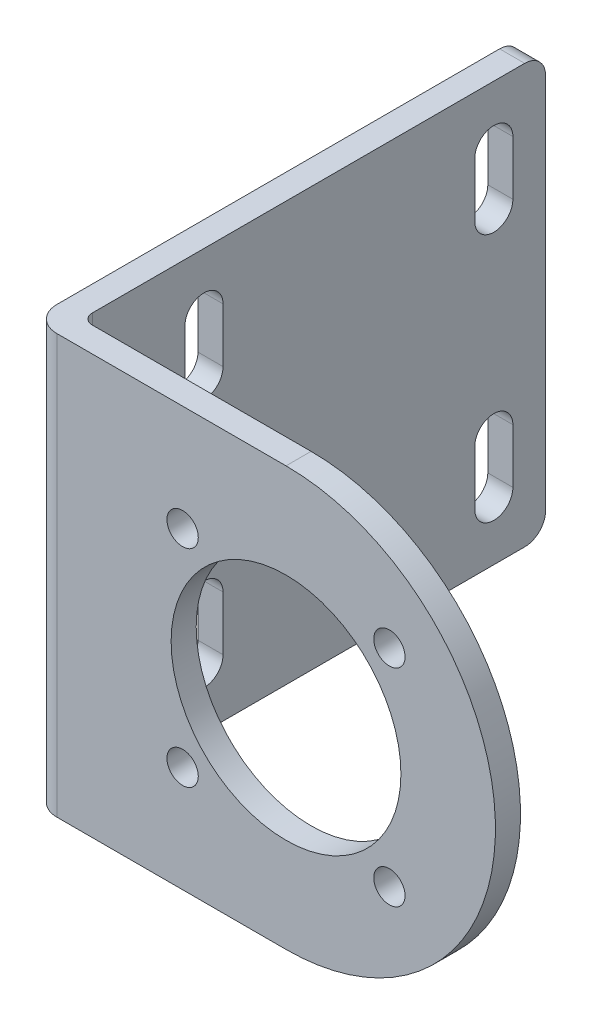
ISO-10303-21;
HEADER;
FILE_DESCRIPTION(('STEP AP214'),'2;1');
FILE_NAME('part.step','',(''),(''),'','','');
FILE_SCHEMA(('AUTOMOTIVE_DESIGN { 1 0 10303 214 1 1 1 1 }'));
ENDSEC;
DATA;
#1=APPLICATION_CONTEXT('core data for automotive mechanical design processes');
#2=APPLICATION_PROTOCOL_DEFINITION('international standard','automotive_design',2000,#1);
#3=PRODUCT_CONTEXT('',#1,'mechanical');
#4=PRODUCT('Part','Part','',(#3));
#5=PRODUCT_RELATED_PRODUCT_CATEGORY('part','',(#4));
#6=PRODUCT_DEFINITION_FORMATION('','',#4);
#7=PRODUCT_DEFINITION_CONTEXT('part definition',#1,'design');
#8=PRODUCT_DEFINITION('design','',#6,#7);
#9=PRODUCT_DEFINITION_SHAPE('','',#8);
#10=(LENGTH_UNIT() NAMED_UNIT(*) SI_UNIT(.MILLI.,.METRE.));
#11=(NAMED_UNIT(*) PLANE_ANGLE_UNIT() SI_UNIT($,.RADIAN.));
#12=(NAMED_UNIT(*) SI_UNIT($,.STERADIAN.) SOLID_ANGLE_UNIT());
#13=UNCERTAINTY_MEASURE_WITH_UNIT(LENGTH_MEASURE(1.E-05),#10,'distance_accuracy_value','');
#14=(GEOMETRIC_REPRESENTATION_CONTEXT(3) GLOBAL_UNCERTAINTY_ASSIGNED_CONTEXT((#13)) GLOBAL_UNIT_ASSIGNED_CONTEXT((#10,
#11,#12)) REPRESENTATION_CONTEXT('',''));
#15=CARTESIAN_POINT('',(0.,0.,0.));
#16=DIRECTION('',(0.,0.,1.));
#17=DIRECTION('',(1.,0.,0.));
#18=AXIS2_PLACEMENT_3D('',#15,#16,#17);
#19=CARTESIAN_POINT('',(0.,0.,0.));
#20=DIRECTION('',(0.,0.,1.));
#21=DIRECTION('',(1.,0.,0.));
#22=AXIS2_PLACEMENT_3D('',#19,#20,#21);
#23=PLANE('',#22);
#24=CARTESIAN_POINT('',(0.,0.,0.));
#25=DIRECTION('',(0.,0.,1.));
#26=DIRECTION('',(1.,0.,0.));
#27=AXIS2_PLACEMENT_3D('',#24,#25,#26);
#28=CIRCLE('',#27,11.);
#29=CARTESIAN_POINT('',(11.,0.,0.));
#30=VERTEX_POINT('',#29);
#31=EDGE_CURVE('E975',#30,#30,#28,.F.);
#32=ORIENTED_EDGE('',*,*,#31,.F.);
#33=EDGE_LOOP('',(#32));
#34=FACE_BOUND('',#33,.T.);
#35=CARTESIAN_POINT('',(9.89949493661172,-9.89949493661161,0.));
#36=DIRECTION('',(0.,0.,1.));
#37=DIRECTION('',(1.,0.,0.));
#38=AXIS2_PLACEMENT_3D('',#35,#36,#37);
#39=CIRCLE('',#38,1.5);
#40=CARTESIAN_POINT('',(11.3994949366117,-9.89949493661161,0.));
#41=VERTEX_POINT('',#40);
#42=EDGE_CURVE('E356',#41,#41,#39,.T.);
#43=ORIENTED_EDGE('',*,*,#42,.T.);
#44=EDGE_LOOP('',(#43));
#45=FACE_BOUND('',#44,.T.);
#46=CARTESIAN_POINT('',(9.89949493661158,9.89949493661175,0.));
#47=DIRECTION('',(0.,0.,1.));
#48=DIRECTION('',(1.,0.,0.));
#49=AXIS2_PLACEMENT_3D('',#46,#47,#48);
#50=CIRCLE('',#49,1.5);
#51=CARTESIAN_POINT('',(11.3994949366116,9.89949493661175,0.));
#52=VERTEX_POINT('',#51);
#53=EDGE_CURVE('E361',#52,#52,#50,.T.);
#54=ORIENTED_EDGE('',*,*,#53,.T.);
#55=EDGE_LOOP('',(#54));
#56=FACE_BOUND('',#55,.T.);
#57=CARTESIAN_POINT('',(-9.89949493661179,9.89949493661154,0.));
#58=DIRECTION('',(0.,0.,1.));
#59=DIRECTION('',(1.,0.,0.));
#60=AXIS2_PLACEMENT_3D('',#57,#58,#59);
#61=CIRCLE('',#60,1.5);
#62=CARTESIAN_POINT('',(-8.39949493661178,9.89949493661154,0.));
#63=VERTEX_POINT('',#62);
#64=EDGE_CURVE('E369',#63,#63,#61,.T.);
#65=ORIENTED_EDGE('',*,*,#64,.T.);
#66=EDGE_LOOP('',(#65));
#67=FACE_BOUND('',#66,.T.);
#68=CARTESIAN_POINT('',(-9.89949493661165,-9.89949493661168,0.));
#69=DIRECTION('',(0.,0.,1.));
#70=DIRECTION('',(1.,0.,0.));
#71=AXIS2_PLACEMENT_3D('',#68,#69,#70);
#72=CIRCLE('',#71,1.5);
#73=CARTESIAN_POINT('',(-8.39949493661165,-9.89949493661168,0.));
#74=VERTEX_POINT('',#73);
#75=EDGE_CURVE('E377',#74,#74,#72,.T.);
#76=ORIENTED_EDGE('',*,*,#75,.T.);
#77=EDGE_LOOP('',(#76));
#78=FACE_BOUND('',#77,.T.);
#79=DIRECTION('',(1.,0.,0.));
#80=VECTOR('',#79,1.);
#81=CARTESIAN_POINT('',(0.,-20.05,0.));
#82=LINE('',#81,#80);
#83=CARTESIAN_POINT('',(-20.95,-20.05,0.));
#84=VERTEX_POINT('',#83);
#85=CARTESIAN_POINT('',(0.,-20.05,0.));
#86=VERTEX_POINT('',#85);
#87=EDGE_CURVE('E385',#84,#86,#82,.T.);
#88=ORIENTED_EDGE('',*,*,#87,.F.);
#89=DIRECTION('',(0.,-1.,0.));
#90=VECTOR('',#89,1.);
#91=CARTESIAN_POINT('',(-20.95,20.05,0.));
#92=LINE('',#91,#90);
#93=CARTESIAN_POINT('',(-20.95,20.05,0.));
#94=VERTEX_POINT('',#93);
#95=EDGE_CURVE('E428',#84,#94,#92,.F.);
#96=ORIENTED_EDGE('',*,*,#95,.T.);
#97=DIRECTION('',(-1.,0.,0.));
#98=VECTOR('',#97,1.);
#99=CARTESIAN_POINT('',(0.,20.05,0.));
#100=LINE('',#99,#98);
#101=CARTESIAN_POINT('',(0.,20.05,0.));
#102=VERTEX_POINT('',#101);
#103=EDGE_CURVE('E393',#102,#94,#100,.T.);
#104=ORIENTED_EDGE('',*,*,#103,.F.);
#105=CARTESIAN_POINT('',(0.,0.,0.));
#106=DIRECTION('',(0.,0.,1.));
#107=DIRECTION('',(1.,0.,0.));
#108=AXIS2_PLACEMENT_3D('',#105,#106,#107);
#109=CIRCLE('',#108,20.05);
#110=EDGE_CURVE('E403',#86,#102,#109,.T.);
#111=ORIENTED_EDGE('',*,*,#110,.F.);
#112=EDGE_LOOP('',(#88,#96,#104,#111));
#113=FACE_BOUND('',#112,.T.);
#114=ADVANCED_FACE('F43',(#34,#45,#56,#67,#78,#113),#23,.F.);
#115=CARTESIAN_POINT('',(0.,0.,2.4));
#116=DIRECTION('',(0.,0.,1.));
#117=DIRECTION('',(1.,0.,0.));
#118=AXIS2_PLACEMENT_3D('',#115,#116,#117);
#119=PLANE('',#118);
#120=CARTESIAN_POINT('',(0.,0.,2.4));
#121=DIRECTION('',(0.,0.,1.));
#122=DIRECTION('',(1.,0.,0.));
#123=AXIS2_PLACEMENT_3D('',#120,#121,#122);
#124=CIRCLE('',#123,11.);
#125=CARTESIAN_POINT('',(11.,0.,2.4));
#126=VERTEX_POINT('',#125);
#127=EDGE_CURVE('E978',#126,#126,#124,.T.);
#128=ORIENTED_EDGE('',*,*,#127,.F.);
#129=EDGE_LOOP('',(#128));
#130=FACE_BOUND('',#129,.T.);
#131=CARTESIAN_POINT('',(9.89949493661158,9.89949493661175,2.4));
#132=DIRECTION('',(0.,0.,1.));
#133=DIRECTION('',(1.,0.,0.));
#134=AXIS2_PLACEMENT_3D('',#131,#132,#133);
#135=CIRCLE('',#134,1.5);
#136=CARTESIAN_POINT('',(11.3994949366116,9.89949493661175,2.4));
#137=VERTEX_POINT('',#136);
#138=EDGE_CURVE('E365',#137,#137,#135,.T.);
#139=ORIENTED_EDGE('',*,*,#138,.F.);
#140=EDGE_LOOP('',(#139));
#141=FACE_BOUND('',#140,.T.);
#142=CARTESIAN_POINT('',(-9.89949493661165,-9.89949493661168,2.4));
#143=DIRECTION('',(0.,0.,1.));
#144=DIRECTION('',(1.,0.,0.));
#145=AXIS2_PLACEMENT_3D('',#142,#143,#144);
#146=CIRCLE('',#145,1.5);
#147=CARTESIAN_POINT('',(-8.39949493661165,-9.89949493661168,2.4));
#148=VERTEX_POINT('',#147);
#149=EDGE_CURVE('E381',#148,#148,#146,.T.);
#150=ORIENTED_EDGE('',*,*,#149,.F.);
#151=EDGE_LOOP('',(#150));
#152=FACE_BOUND('',#151,.T.);
#153=DIRECTION('',(-1.,0.,0.));
#154=VECTOR('',#153,1.);
#155=CARTESIAN_POINT('',(0.,20.05,2.4));
#156=LINE('',#155,#154);
#157=CARTESIAN_POINT('',(0.,20.05,2.4));
#158=VERTEX_POINT('',#157);
#159=CARTESIAN_POINT('',(-21.95,20.05,2.4));
#160=VERTEX_POINT('',#159);
#161=EDGE_CURVE('E396',#158,#160,#156,.T.);
#162=ORIENTED_EDGE('',*,*,#161,.T.);
#163=DIRECTION('',(0.,-1.,0.));
#164=VECTOR('',#163,1.);
#165=CARTESIAN_POINT('',(-21.95,-20.05,2.4));
#166=LINE('',#165,#164);
#167=CARTESIAN_POINT('',(-21.95,-20.05,2.4));
#168=VERTEX_POINT('',#167);
#169=EDGE_CURVE('E438',#160,#168,#166,.T.);
#170=ORIENTED_EDGE('',*,*,#169,.T.);
#171=DIRECTION('',(1.,0.,0.));
#172=VECTOR('',#171,1.);
#173=CARTESIAN_POINT('',(0.,-20.05,2.4));
#174=LINE('',#173,#172);
#175=CARTESIAN_POINT('',(0.,-20.05,2.4));
#176=VERTEX_POINT('',#175);
#177=EDGE_CURVE('E389',#168,#176,#174,.T.);
#178=ORIENTED_EDGE('',*,*,#177,.T.);
#179=CARTESIAN_POINT('',(0.,0.,2.4));
#180=DIRECTION('',(0.,0.,1.));
#181=DIRECTION('',(1.,0.,0.));
#182=AXIS2_PLACEMENT_3D('',#179,#180,#181);
#183=CIRCLE('',#182,20.05);
#184=EDGE_CURVE('E392',#176,#158,#183,.T.);
#185=ORIENTED_EDGE('',*,*,#184,.T.);
#186=EDGE_LOOP('',(#162,#170,#178,#185));
#187=FACE_BOUND('',#186,.T.);
#188=CARTESIAN_POINT('',(-9.89949493661179,9.89949493661154,2.4));
#189=DIRECTION('',(0.,0.,1.));
#190=DIRECTION('',(1.,0.,0.));
#191=AXIS2_PLACEMENT_3D('',#188,#189,#190);
#192=CIRCLE('',#191,1.5);
#193=CARTESIAN_POINT('',(-8.39949493661178,9.89949493661154,2.4));
#194=VERTEX_POINT('',#193);
#195=EDGE_CURVE('E373',#194,#194,#192,.T.);
#196=ORIENTED_EDGE('',*,*,#195,.F.);
#197=EDGE_LOOP('',(#196));
#198=FACE_BOUND('',#197,.T.);
#199=CARTESIAN_POINT('',(9.89949493661172,-9.89949493661161,2.4));
#200=DIRECTION('',(0.,0.,1.));
#201=DIRECTION('',(1.,0.,0.));
#202=AXIS2_PLACEMENT_3D('',#199,#200,#201);
#203=CIRCLE('',#202,1.5);
#204=CARTESIAN_POINT('',(11.3994949366117,-9.89949493661161,2.4));
#205=VERTEX_POINT('',#204);
#206=EDGE_CURVE('E357',#205,#205,#203,.T.);
#207=ORIENTED_EDGE('',*,*,#206,.F.);
#208=EDGE_LOOP('',(#207));
#209=FACE_BOUND('',#208,.T.);
#210=ADVANCED_FACE('F564',(#130,#141,#152,#187,#198,#209),#119,.T.);
#211=CARTESIAN_POINT('',(-24.35,-20.05,2.4));
#212=DIRECTION('',(1.,0.,0.));
#213=DIRECTION('',(0.,0.,-1.));
#214=AXIS2_PLACEMENT_3D('',#211,#212,#213);
#215=PLANE('',#214);
#216=DIRECTION('',(0.,-1.,0.));
#217=VECTOR('',#216,1.);
#218=CARTESIAN_POINT('',(-24.35,-9.34500000000001,-41.27));
#219=LINE('',#218,#217);
#220=CARTESIAN_POINT('',(-24.35,-9.34500000000001,-41.27));
#221=VERTEX_POINT('',#220);
#222=CARTESIAN_POINT('',(-24.35,-14.545,-41.27));
#223=VERTEX_POINT('',#222);
#224=EDGE_CURVE('E264',#221,#223,#219,.T.);
#225=ORIENTED_EDGE('',*,*,#224,.F.);
#226=CARTESIAN_POINT('',(-24.35,-9.34500000000001,-39.445));
#227=DIRECTION('',(-1.,0.,0.));
#228=DIRECTION('',(0.,0.,-1.));
#229=AXIS2_PLACEMENT_3D('',#226,#227,#228);
#230=CIRCLE('',#229,1.82500000000001);
#231=CARTESIAN_POINT('',(-24.35,-9.34500000000001,-37.62));
#232=VERTEX_POINT('',#231);
#233=EDGE_CURVE('E59',#232,#221,#230,.T.);
#234=ORIENTED_EDGE('',*,*,#233,.F.);
#235=DIRECTION('',(0.,1.,0.));
#236=VECTOR('',#235,1.);
#237=CARTESIAN_POINT('',(-24.35,-9.34500000000001,-37.62));
#238=LINE('',#237,#236);
#239=CARTESIAN_POINT('',(-24.35,-14.545,-37.62));
#240=VERTEX_POINT('',#239);
#241=EDGE_CURVE('E273',#240,#232,#238,.T.);
#242=ORIENTED_EDGE('',*,*,#241,.F.);
#243=CARTESIAN_POINT('',(-24.35,-14.545,-39.445));
#244=DIRECTION('',(-1.,0.,0.));
#245=DIRECTION('',(0.,0.,-1.));
#246=AXIS2_PLACEMENT_3D('',#243,#244,#245);
#247=CIRCLE('',#246,1.825);
#248=EDGE_CURVE('E269',#223,#240,#247,.T.);
#249=ORIENTED_EDGE('',*,*,#248,.F.);
#250=EDGE_LOOP('',(#225,#234,#242,#249));
#251=FACE_BOUND('',#250,.T.);
#252=DIRECTION('',(0.,1.,0.));
#253=VECTOR('',#252,1.);
#254=CARTESIAN_POINT('',(-24.35,9.345,-9.87));
#255=LINE('',#254,#253);
#256=CARTESIAN_POINT('',(-24.35,9.345,-9.87));
#257=VERTEX_POINT('',#256);
#258=CARTESIAN_POINT('',(-24.35,14.545,-9.87000000000001));
#259=VERTEX_POINT('',#258);
#260=EDGE_CURVE('E292',#257,#259,#255,.T.);
#261=ORIENTED_EDGE('',*,*,#260,.F.);
#262=CARTESIAN_POINT('',(-24.35,9.345,-11.695));
#263=DIRECTION('',(-1.,0.,0.));
#264=DIRECTION('',(0.,0.,1.));
#265=AXIS2_PLACEMENT_3D('',#262,#263,#264);
#266=CIRCLE('',#265,1.825);
#267=CARTESIAN_POINT('',(-24.35,9.345,-13.52));
#268=VERTEX_POINT('',#267);
#269=EDGE_CURVE('E67',#268,#257,#266,.T.);
#270=ORIENTED_EDGE('',*,*,#269,.F.);
#271=DIRECTION('',(0.,-1.,0.));
#272=VECTOR('',#271,1.);
#273=CARTESIAN_POINT('',(-24.35,9.345,-13.52));
#274=LINE('',#273,#272);
#275=CARTESIAN_POINT('',(-24.35,14.545,-13.52));
#276=VERTEX_POINT('',#275);
#277=EDGE_CURVE('E300',#276,#268,#274,.T.);
#278=ORIENTED_EDGE('',*,*,#277,.F.);
#279=CARTESIAN_POINT('',(-24.35,14.545,-11.695));
#280=DIRECTION('',(-1.,0.,0.));
#281=DIRECTION('',(0.,0.,1.));
#282=AXIS2_PLACEMENT_3D('',#279,#280,#281);
#283=CIRCLE('',#282,1.825);
#284=EDGE_CURVE('E296',#259,#276,#283,.T.);
#285=ORIENTED_EDGE('',*,*,#284,.F.);
#286=EDGE_LOOP('',(#261,#270,#278,#285));
#287=FACE_BOUND('',#286,.T.);
#288=DIRECTION('',(0.,-1.,0.));
#289=VECTOR('',#288,1.);
#290=CARTESIAN_POINT('',(-24.35,-9.34500000000001,-13.52));
#291=LINE('',#290,#289);
#292=CARTESIAN_POINT('',(-24.35,-9.34500000000001,-13.52));
#293=VERTEX_POINT('',#292);
#294=CARTESIAN_POINT('',(-24.35,-14.545,-13.52));
#295=VERTEX_POINT('',#294);
#296=EDGE_CURVE('E236',#293,#295,#291,.T.);
#297=ORIENTED_EDGE('',*,*,#296,.F.);
#298=CARTESIAN_POINT('',(-24.35,-9.34500000000001,-11.695));
#299=DIRECTION('',(-1.,0.,0.));
#300=DIRECTION('',(0.,0.,-1.));
#301=AXIS2_PLACEMENT_3D('',#298,#299,#300);
#302=CIRCLE('',#301,1.825);
#303=CARTESIAN_POINT('',(-24.35,-9.34500000000001,-9.87));
#304=VERTEX_POINT('',#303);
#305=EDGE_CURVE('E242',#304,#293,#302,.T.);
#306=ORIENTED_EDGE('',*,*,#305,.F.);
#307=DIRECTION('',(0.,1.,0.));
#308=VECTOR('',#307,1.);
#309=CARTESIAN_POINT('',(-24.35,-9.34500000000001,-9.87));
#310=LINE('',#309,#308);
#311=CARTESIAN_POINT('',(-24.35,-14.545,-9.87));
#312=VERTEX_POINT('',#311);
#313=EDGE_CURVE('E247',#312,#304,#310,.T.);
#314=ORIENTED_EDGE('',*,*,#313,.F.);
#315=CARTESIAN_POINT('',(-24.35,-14.545,-11.695));
#316=DIRECTION('',(-1.,0.,0.));
#317=DIRECTION('',(0.,0.,-1.));
#318=AXIS2_PLACEMENT_3D('',#315,#316,#317);
#319=CIRCLE('',#318,1.825);
#320=EDGE_CURVE('E224',#295,#312,#319,.T.);
#321=ORIENTED_EDGE('',*,*,#320,.F.);
#322=EDGE_LOOP('',(#297,#306,#314,#321));
#323=FACE_BOUND('',#322,.T.);
#324=DIRECTION('',(0.,1.,0.));
#325=VECTOR('',#324,1.);
#326=CARTESIAN_POINT('',(-24.35,9.345,-37.62));
#327=LINE('',#326,#325);
#328=CARTESIAN_POINT('',(-24.35,9.345,-37.62));
#329=VERTEX_POINT('',#328);
#330=CARTESIAN_POINT('',(-24.35,14.545,-37.62));
#331=VERTEX_POINT('',#330);
#332=EDGE_CURVE('E317',#329,#331,#327,.T.);
#333=ORIENTED_EDGE('',*,*,#332,.F.);
#334=CARTESIAN_POINT('',(-24.35,9.345,-39.445));
#335=DIRECTION('',(-1.,0.,0.));
#336=DIRECTION('',(0.,0.,1.));
#337=AXIS2_PLACEMENT_3D('',#334,#335,#336);
#338=CIRCLE('',#337,1.82500000000001);
#339=CARTESIAN_POINT('',(-24.35,9.345,-41.27));
#340=VERTEX_POINT('',#339);
#341=EDGE_CURVE('E281',#340,#329,#338,.T.);
#342=ORIENTED_EDGE('',*,*,#341,.F.);
#343=DIRECTION('',(0.,-1.,0.));
#344=VECTOR('',#343,1.);
#345=CARTESIAN_POINT('',(-24.35,9.345,-41.27));
#346=LINE('',#345,#344);
#347=CARTESIAN_POINT('',(-24.35,14.545,-41.27));
#348=VERTEX_POINT('',#347);
#349=EDGE_CURVE('E325',#348,#340,#346,.T.);
#350=ORIENTED_EDGE('',*,*,#349,.F.);
#351=CARTESIAN_POINT('',(-24.35,14.545,-39.445));
#352=DIRECTION('',(-1.,0.,0.));
#353=DIRECTION('',(0.,0.,1.));
#354=AXIS2_PLACEMENT_3D('',#351,#352,#353);
#355=CIRCLE('',#354,1.825);
#356=EDGE_CURVE('E321',#331,#348,#355,.T.);
#357=ORIENTED_EDGE('',*,*,#356,.F.);
#358=EDGE_LOOP('',(#333,#342,#350,#357));
#359=FACE_BOUND('',#358,.T.);
#360=DIRECTION('',(0.,0.,-1.));
#361=VECTOR('',#360,1.);
#362=CARTESIAN_POINT('',(-24.35,20.05,2.4));
#363=LINE('',#362,#361);
#364=CARTESIAN_POINT('',(-24.35,20.05,0.));
#365=VERTEX_POINT('',#364);
#366=CARTESIAN_POINT('',(-24.35,20.05,-42.4));
#367=VERTEX_POINT('',#366);
#368=EDGE_CURVE('E400',#365,#367,#363,.T.);
#369=ORIENTED_EDGE('',*,*,#368,.T.);
#370=CARTESIAN_POINT('',(-24.35,18.05,-42.4));
#371=DIRECTION('',(1.,0.,0.));
#372=DIRECTION('',(0.,0.,-1.));
#373=AXIS2_PLACEMENT_3D('',#370,#371,#372);
#374=CIRCLE('',#373,2.);
#375=CARTESIAN_POINT('',(-24.35,18.05,-44.4));
#376=VERTEX_POINT('',#375);
#377=EDGE_CURVE('E471',#367,#376,#374,.F.);
#378=ORIENTED_EDGE('',*,*,#377,.T.);
#379=DIRECTION('',(0.,1.,0.));
#380=VECTOR('',#379,1.);
#381=CARTESIAN_POINT('',(-24.35,-20.05,-44.4));
#382=LINE('',#381,#380);
#383=CARTESIAN_POINT('',(-24.35,-18.05,-44.4));
#384=VERTEX_POINT('',#383);
#385=EDGE_CURVE('E333',#384,#376,#382,.T.);
#386=ORIENTED_EDGE('',*,*,#385,.F.);
#387=CARTESIAN_POINT('',(-24.35,-18.05,-42.4));
#388=DIRECTION('',(1.,0.,0.));
#389=DIRECTION('',(0.,0.,-1.));
#390=AXIS2_PLACEMENT_3D('',#387,#388,#389);
#391=CIRCLE('',#390,2.);
#392=CARTESIAN_POINT('',(-24.35,-20.05,-42.4));
#393=VERTEX_POINT('',#392);
#394=EDGE_CURVE('E468',#384,#393,#391,.F.);
#395=ORIENTED_EDGE('',*,*,#394,.T.);
#396=DIRECTION('',(0.,0.,-1.));
#397=VECTOR('',#396,1.);
#398=CARTESIAN_POINT('',(-24.35,-20.05,2.4));
#399=LINE('',#398,#397);
#400=CARTESIAN_POINT('',(-24.35,-20.05,0.));
#401=VERTEX_POINT('',#400);
#402=EDGE_CURVE('E420',#401,#393,#399,.T.);
#403=ORIENTED_EDGE('',*,*,#402,.F.);
#404=DIRECTION('',(0.,-1.,0.));
#405=VECTOR('',#404,1.);
#406=CARTESIAN_POINT('',(-24.35,20.05,0.));
#407=LINE('',#406,#405);
#408=EDGE_CURVE('E445',#401,#365,#407,.F.);
#409=ORIENTED_EDGE('',*,*,#408,.T.);
#410=EDGE_LOOP('',(#369,#378,#386,#395,#403,#409));
#411=FACE_BOUND('',#410,.T.);
#412=ADVANCED_FACE('F244',(#251,#287,#323,#359,#411),#215,.F.);
#413=CARTESIAN_POINT('',(0.,-20.05,2.4));
#414=DIRECTION('',(0.,1.,0.));
#415=DIRECTION('',(0.,0.,1.));
#416=AXIS2_PLACEMENT_3D('',#413,#414,#415);
#417=PLANE('',#416);
#418=ORIENTED_EDGE('',*,*,#402,.T.);
#419=DIRECTION('',(-1.,0.,0.));
#420=VECTOR('',#419,1.);
#421=CARTESIAN_POINT('',(-21.95,-20.05,-42.4));
#422=LINE('',#421,#420);
#423=CARTESIAN_POINT('',(-21.95,-20.05,-42.4));
#424=VERTEX_POINT('',#423);
#425=EDGE_CURVE('E474',#393,#424,#422,.F.);
#426=ORIENTED_EDGE('',*,*,#425,.T.);
#427=DIRECTION('',(0.,0.,1.));
#428=VECTOR('',#427,1.);
#429=CARTESIAN_POINT('',(-21.95,-20.05,-44.4));
#430=LINE('',#429,#428);
#431=CARTESIAN_POINT('',(-21.95,-20.05,-1.));
#432=VERTEX_POINT('',#431);
#433=EDGE_CURVE('E350',#424,#432,#430,.T.);
#434=ORIENTED_EDGE('',*,*,#433,.T.);
#435=CARTESIAN_POINT('',(-20.95,-20.05,-1.));
#436=DIRECTION('',(0.,1.,0.));
#437=DIRECTION('',(0.,0.,1.));
#438=AXIS2_PLACEMENT_3D('',#435,#436,#437);
#439=CIRCLE('',#438,1.);
#440=EDGE_CURVE('E431',#432,#84,#439,.T.);
#441=ORIENTED_EDGE('',*,*,#440,.T.);
#442=ORIENTED_EDGE('',*,*,#87,.T.);
#443=DIRECTION('',(0.,0.,-1.));
#444=VECTOR('',#443,1.);
#445=CARTESIAN_POINT('',(0.,-20.05,2.4));
#446=LINE('',#445,#444);
#447=EDGE_CURVE('E416',#176,#86,#446,.T.);
#448=ORIENTED_EDGE('',*,*,#447,.F.);
#449=ORIENTED_EDGE('',*,*,#177,.F.);
#450=CARTESIAN_POINT('',(-21.95,-20.05,0.));
#451=DIRECTION('',(0.,1.,0.));
#452=DIRECTION('',(0.,0.,1.));
#453=AXIS2_PLACEMENT_3D('',#450,#451,#452);
#454=CIRCLE('',#453,2.4);
#455=EDGE_CURVE('E442',#168,#401,#454,.F.);
#456=ORIENTED_EDGE('',*,*,#455,.T.);
#457=EDGE_LOOP('',(#418,#426,#434,#441,#442,#448,#449,#456));
#458=FACE_BOUND('',#457,.T.);
#459=ADVANCED_FACE('F584',(#458),#417,.F.);
#460=CARTESIAN_POINT('',(0.,0.,2.4));
#461=DIRECTION('',(0.,0.,-1.));
#462=DIRECTION('',(-1.,0.,0.));
#463=AXIS2_PLACEMENT_3D('',#460,#461,#462);
#464=CYLINDRICAL_SURFACE('',#463,20.05);
#465=ORIENTED_EDGE('',*,*,#110,.T.);
#466=DIRECTION('',(0.,0.,-1.));
#467=VECTOR('',#466,1.);
#468=CARTESIAN_POINT('',(0.,20.05,2.4));
#469=LINE('',#468,#467);
#470=EDGE_CURVE('E412',#158,#102,#469,.T.);
#471=ORIENTED_EDGE('',*,*,#470,.F.);
#472=ORIENTED_EDGE('',*,*,#184,.F.);
#473=ORIENTED_EDGE('',*,*,#447,.T.);
#474=EDGE_LOOP('',(#465,#471,#472,#473));
#475=FACE_BOUND('',#474,.T.);
#476=ADVANCED_FACE('F580',(#475),#464,.T.);
#477=CARTESIAN_POINT('',(0.,20.05,2.4));
#478=DIRECTION('',(0.,-1.,0.));
#479=DIRECTION('',(1.,0.,0.));
#480=AXIS2_PLACEMENT_3D('',#477,#478,#479);
#481=PLANE('',#480);
#482=DIRECTION('',(0.,0.,1.));
#483=VECTOR('',#482,1.);
#484=CARTESIAN_POINT('',(-21.95,20.05,-44.4));
#485=LINE('',#484,#483);
#486=CARTESIAN_POINT('',(-21.95,20.05,-42.4));
#487=VERTEX_POINT('',#486);
#488=CARTESIAN_POINT('',(-21.95,20.05,-1.));
#489=VERTEX_POINT('',#488);
#490=EDGE_CURVE('E353',#487,#489,#485,.T.);
#491=ORIENTED_EDGE('',*,*,#490,.F.);
#492=DIRECTION('',(1.,0.,0.));
#493=VECTOR('',#492,1.);
#494=CARTESIAN_POINT('',(-24.35,20.05,-42.4));
#495=LINE('',#494,#493);
#496=EDGE_CURVE('E465',#487,#367,#495,.F.);
#497=ORIENTED_EDGE('',*,*,#496,.T.);
#498=ORIENTED_EDGE('',*,*,#368,.F.);
#499=CARTESIAN_POINT('',(-21.95,20.05,0.));
#500=DIRECTION('',(0.,-1.,0.));
#501=DIRECTION('',(1.,0.,0.));
#502=AXIS2_PLACEMENT_3D('',#499,#500,#501);
#503=CIRCLE('',#502,2.4);
#504=EDGE_CURVE('E448',#365,#160,#503,.F.);
#505=ORIENTED_EDGE('',*,*,#504,.T.);
#506=ORIENTED_EDGE('',*,*,#161,.F.);
#507=ORIENTED_EDGE('',*,*,#470,.T.);
#508=ORIENTED_EDGE('',*,*,#103,.T.);
#509=CARTESIAN_POINT('',(-20.95,20.05,-1.));
#510=DIRECTION('',(0.,-1.,0.));
#511=DIRECTION('',(1.,0.,0.));
#512=AXIS2_PLACEMENT_3D('',#509,#510,#511);
#513=CIRCLE('',#512,1.);
#514=EDGE_CURVE('E434',#94,#489,#513,.T.);
#515=ORIENTED_EDGE('',*,*,#514,.T.);
#516=EDGE_LOOP('',(#491,#497,#498,#505,#506,#507,#508,#515));
#517=FACE_BOUND('',#516,.T.);
#518=ADVANCED_FACE('F576',(#517),#481,.F.);
#519=CARTESIAN_POINT('',(-9.89949493661165,-9.89949493661168,2.4));
#520=DIRECTION('',(0.,0.,-1.));
#521=DIRECTION('',(-1.,0.,0.));
#522=AXIS2_PLACEMENT_3D('',#519,#520,#521);
#523=CYLINDRICAL_SURFACE('',#522,1.5);
#524=ORIENTED_EDGE('',*,*,#149,.T.);
#525=EDGE_LOOP('',(#524));
#526=FACE_BOUND('',#525,.T.);
#527=ORIENTED_EDGE('',*,*,#75,.F.);
#528=EDGE_LOOP('',(#527));
#529=FACE_BOUND('',#528,.T.);
#530=ADVANCED_FACE('F579',(#526,#529),#523,.F.);
#531=CARTESIAN_POINT('',(-9.89949493661179,9.89949493661154,2.4));
#532=DIRECTION('',(0.,0.,-1.));
#533=DIRECTION('',(-1.,0.,0.));
#534=AXIS2_PLACEMENT_3D('',#531,#532,#533);
#535=CYLINDRICAL_SURFACE('',#534,1.5);
#536=ORIENTED_EDGE('',*,*,#195,.T.);
#537=EDGE_LOOP('',(#536));
#538=FACE_BOUND('',#537,.T.);
#539=ORIENTED_EDGE('',*,*,#64,.F.);
#540=EDGE_LOOP('',(#539));
#541=FACE_BOUND('',#540,.T.);
#542=ADVANCED_FACE('F655',(#538,#541),#535,.F.);
#543=CARTESIAN_POINT('',(9.89949493661158,9.89949493661175,2.4));
#544=DIRECTION('',(0.,0.,-1.));
#545=DIRECTION('',(-1.,0.,0.));
#546=AXIS2_PLACEMENT_3D('',#543,#544,#545);
#547=CYLINDRICAL_SURFACE('',#546,1.5);
#548=ORIENTED_EDGE('',*,*,#138,.T.);
#549=EDGE_LOOP('',(#548));
#550=FACE_BOUND('',#549,.T.);
#551=ORIENTED_EDGE('',*,*,#53,.F.);
#552=EDGE_LOOP('',(#551));
#553=FACE_BOUND('',#552,.T.);
#554=ADVANCED_FACE('F648',(#550,#553),#547,.F.);
#555=CARTESIAN_POINT('',(9.89949493661172,-9.89949493661161,2.4));
#556=DIRECTION('',(0.,0.,-1.));
#557=DIRECTION('',(-1.,0.,0.));
#558=AXIS2_PLACEMENT_3D('',#555,#556,#557);
#559=CYLINDRICAL_SURFACE('',#558,1.5);
#560=ORIENTED_EDGE('',*,*,#206,.T.);
#561=EDGE_LOOP('',(#560));
#562=FACE_BOUND('',#561,.T.);
#563=ORIENTED_EDGE('',*,*,#42,.F.);
#564=EDGE_LOOP('',(#563));
#565=FACE_BOUND('',#564,.T.);
#566=ADVANCED_FACE('F641',(#562,#565),#559,.F.);
#567=CARTESIAN_POINT('',(-21.95,-20.05,-44.4));
#568=DIRECTION('',(-1.,0.,0.));
#569=DIRECTION('',(0.,0.,1.));
#570=AXIS2_PLACEMENT_3D('',#567,#568,#569);
#571=PLANE('',#570);
#572=DIRECTION('',(0.,1.,0.));
#573=VECTOR('',#572,1.);
#574=CARTESIAN_POINT('',(-21.95,-20.05,-37.62));
#575=LINE('',#574,#573);
#576=CARTESIAN_POINT('',(-21.95,-14.545,-37.62));
#577=VERTEX_POINT('',#576);
#578=CARTESIAN_POINT('',(-21.95,-9.34500000000001,-37.62));
#579=VERTEX_POINT('',#578);
#580=EDGE_CURVE('E52',#577,#579,#575,.T.);
#581=ORIENTED_EDGE('',*,*,#580,.T.);
#582=CARTESIAN_POINT('',(-21.95,-9.34500000000001,-39.445));
#583=DIRECTION('',(-1.,0.,0.));
#584=DIRECTION('',(0.,0.,1.));
#585=AXIS2_PLACEMENT_3D('',#582,#583,#584);
#586=CIRCLE('',#585,1.82500000000001);
#587=CARTESIAN_POINT('',(-21.95,-9.34500000000001,-41.27));
#588=VERTEX_POINT('',#587);
#589=EDGE_CURVE('E11',#579,#588,#586,.T.);
#590=ORIENTED_EDGE('',*,*,#589,.T.);
#591=DIRECTION('',(0.,-1.,0.));
#592=VECTOR('',#591,1.);
#593=CARTESIAN_POINT('',(-21.95,-20.05,-41.27));
#594=LINE('',#593,#592);
#595=CARTESIAN_POINT('',(-21.95,-14.545,-41.27));
#596=VERTEX_POINT('',#595);
#597=EDGE_CURVE('E522',#588,#596,#594,.T.);
#598=ORIENTED_EDGE('',*,*,#597,.T.);
#599=CARTESIAN_POINT('',(-21.95,-14.545,-39.445));
#600=DIRECTION('',(-1.,0.,0.));
#601=DIRECTION('',(0.,0.,1.));
#602=AXIS2_PLACEMENT_3D('',#599,#600,#601);
#603=CIRCLE('',#602,1.825);
#604=EDGE_CURVE('E526',#596,#577,#603,.T.);
#605=ORIENTED_EDGE('',*,*,#604,.T.);
#606=EDGE_LOOP('',(#581,#590,#598,#605));
#607=FACE_BOUND('',#606,.T.);
#608=DIRECTION('',(0.,-1.,0.));
#609=VECTOR('',#608,1.);
#610=CARTESIAN_POINT('',(-21.95,-20.05,-13.52));
#611=LINE('',#610,#609);
#612=CARTESIAN_POINT('',(-21.95,14.545,-13.52));
#613=VERTEX_POINT('',#612);
#614=CARTESIAN_POINT('',(-21.95,9.345,-13.52));
#615=VERTEX_POINT('',#614);
#616=EDGE_CURVE('E514',#613,#615,#611,.T.);
#617=ORIENTED_EDGE('',*,*,#616,.T.);
#618=CARTESIAN_POINT('',(-21.95,9.345,-11.695));
#619=DIRECTION('',(-1.,0.,0.));
#620=DIRECTION('',(0.,0.,1.));
#621=AXIS2_PLACEMENT_3D('',#618,#619,#620);
#622=CIRCLE('',#621,1.825);
#623=CARTESIAN_POINT('',(-21.95,9.345,-9.87));
#624=VERTEX_POINT('',#623);
#625=EDGE_CURVE('E518',#615,#624,#622,.T.);
#626=ORIENTED_EDGE('',*,*,#625,.T.);
#627=DIRECTION('',(0.,1.,0.));
#628=VECTOR('',#627,1.);
#629=CARTESIAN_POINT('',(-21.95,-20.05,-9.86999999999998));
#630=LINE('',#629,#628);
#631=CARTESIAN_POINT('',(-21.95,14.545,-9.87));
#632=VERTEX_POINT('',#631);
#633=EDGE_CURVE('E506',#624,#632,#630,.T.);
#634=ORIENTED_EDGE('',*,*,#633,.T.);
#635=CARTESIAN_POINT('',(-21.95,14.545,-11.695));
#636=DIRECTION('',(-1.,0.,0.));
#637=DIRECTION('',(0.,0.,1.));
#638=AXIS2_PLACEMENT_3D('',#635,#636,#637);
#639=CIRCLE('',#638,1.825);
#640=EDGE_CURVE('E510',#632,#613,#639,.T.);
#641=ORIENTED_EDGE('',*,*,#640,.T.);
#642=EDGE_LOOP('',(#617,#626,#634,#641));
#643=FACE_BOUND('',#642,.T.);
#644=DIRECTION('',(0.,1.,0.));
#645=VECTOR('',#644,1.);
#646=CARTESIAN_POINT('',(-21.95,-20.05,-9.87));
#647=LINE('',#646,#645);
#648=CARTESIAN_POINT('',(-21.95,-14.545,-9.87));
#649=VERTEX_POINT('',#648);
#650=CARTESIAN_POINT('',(-21.95,-9.34500000000001,-9.87));
#651=VERTEX_POINT('',#650);
#652=EDGE_CURVE('E498',#649,#651,#647,.T.);
#653=ORIENTED_EDGE('',*,*,#652,.T.);
#654=CARTESIAN_POINT('',(-21.95,-9.34500000000001,-11.695));
#655=DIRECTION('',(-1.,0.,0.));
#656=DIRECTION('',(0.,0.,1.));
#657=AXIS2_PLACEMENT_3D('',#654,#655,#656);
#658=CIRCLE('',#657,1.825);
#659=CARTESIAN_POINT('',(-21.95,-9.34500000000001,-13.52));
#660=VERTEX_POINT('',#659);
#661=EDGE_CURVE('E502',#651,#660,#658,.T.);
#662=ORIENTED_EDGE('',*,*,#661,.T.);
#663=DIRECTION('',(0.,-1.,0.));
#664=VECTOR('',#663,1.);
#665=CARTESIAN_POINT('',(-21.95,-20.05,-13.52));
#666=LINE('',#665,#664);
#667=CARTESIAN_POINT('',(-21.95,-14.545,-13.52));
#668=VERTEX_POINT('',#667);
#669=EDGE_CURVE('E493',#660,#668,#666,.T.);
#670=ORIENTED_EDGE('',*,*,#669,.T.);
#671=CARTESIAN_POINT('',(-21.95,-14.545,-11.695));
#672=DIRECTION('',(-1.,0.,0.));
#673=DIRECTION('',(0.,0.,1.));
#674=AXIS2_PLACEMENT_3D('',#671,#672,#673);
#675=CIRCLE('',#674,1.825);
#676=EDGE_CURVE('E227',#668,#649,#675,.T.);
#677=ORIENTED_EDGE('',*,*,#676,.T.);
#678=EDGE_LOOP('',(#653,#662,#670,#677));
#679=FACE_BOUND('',#678,.T.);
#680=DIRECTION('',(0.,-1.,0.));
#681=VECTOR('',#680,1.);
#682=CARTESIAN_POINT('',(-21.95,-20.05,-41.27));
#683=LINE('',#682,#681);
#684=CARTESIAN_POINT('',(-21.95,14.545,-41.27));
#685=VERTEX_POINT('',#684);
#686=CARTESIAN_POINT('',(-21.95,9.345,-41.27));
#687=VERTEX_POINT('',#686);
#688=EDGE_CURVE('E485',#685,#687,#683,.T.);
#689=ORIENTED_EDGE('',*,*,#688,.T.);
#690=CARTESIAN_POINT('',(-21.95,9.345,-39.445));
#691=DIRECTION('',(-1.,0.,0.));
#692=DIRECTION('',(0.,0.,1.));
#693=AXIS2_PLACEMENT_3D('',#690,#691,#692);
#694=CIRCLE('',#693,1.82500000000001);
#695=CARTESIAN_POINT('',(-21.95,9.345,-37.62));
#696=VERTEX_POINT('',#695);
#697=EDGE_CURVE('E489',#687,#696,#694,.T.);
#698=ORIENTED_EDGE('',*,*,#697,.T.);
#699=DIRECTION('',(0.,1.,0.));
#700=VECTOR('',#699,1.);
#701=CARTESIAN_POINT('',(-21.95,-20.05,-37.6199999999999));
#702=LINE('',#701,#700);
#703=CARTESIAN_POINT('',(-21.95,14.545,-37.62));
#704=VERTEX_POINT('',#703);
#705=EDGE_CURVE('E477',#696,#704,#702,.T.);
#706=ORIENTED_EDGE('',*,*,#705,.T.);
#707=CARTESIAN_POINT('',(-21.95,14.545,-39.445));
#708=DIRECTION('',(-1.,0.,0.));
#709=DIRECTION('',(0.,0.,1.));
#710=AXIS2_PLACEMENT_3D('',#707,#708,#709);
#711=CIRCLE('',#710,1.825);
#712=EDGE_CURVE('E481',#704,#685,#711,.T.);
#713=ORIENTED_EDGE('',*,*,#712,.T.);
#714=EDGE_LOOP('',(#689,#698,#706,#713));
#715=FACE_BOUND('',#714,.T.);
#716=DIRECTION('',(0.,-1.,0.));
#717=VECTOR('',#716,1.);
#718=CARTESIAN_POINT('',(-21.95,-20.05,-44.4));
#719=LINE('',#718,#717);
#720=CARTESIAN_POINT('',(-21.95,18.05,-44.4));
#721=VERTEX_POINT('',#720);
#722=CARTESIAN_POINT('',(-21.95,-18.05,-44.4));
#723=VERTEX_POINT('',#722);
#724=EDGE_CURVE('E346',#721,#723,#719,.T.);
#725=ORIENTED_EDGE('',*,*,#724,.F.);
#726=CARTESIAN_POINT('',(-21.95,18.05,-42.4));
#727=DIRECTION('',(-1.,0.,0.));
#728=DIRECTION('',(0.,0.,1.));
#729=AXIS2_PLACEMENT_3D('',#726,#727,#728);
#730=CIRCLE('',#729,2.);
#731=EDGE_CURVE('E462',#721,#487,#730,.F.);
#732=ORIENTED_EDGE('',*,*,#731,.T.);
#733=ORIENTED_EDGE('',*,*,#490,.T.);
#734=DIRECTION('',(0.,-1.,0.));
#735=VECTOR('',#734,1.);
#736=CARTESIAN_POINT('',(-21.95,-20.05,-1.));
#737=LINE('',#736,#735);
#738=EDGE_CURVE('E424',#489,#432,#737,.T.);
#739=ORIENTED_EDGE('',*,*,#738,.T.);
#740=ORIENTED_EDGE('',*,*,#433,.F.);
#741=CARTESIAN_POINT('',(-21.95,-18.05,-42.4));
#742=DIRECTION('',(-1.,0.,0.));
#743=DIRECTION('',(0.,0.,1.));
#744=AXIS2_PLACEMENT_3D('',#741,#742,#743);
#745=CIRCLE('',#744,2.);
#746=EDGE_CURVE('E459',#424,#723,#745,.F.);
#747=ORIENTED_EDGE('',*,*,#746,.T.);
#748=EDGE_LOOP('',(#725,#732,#733,#739,#740,#747));
#749=FACE_BOUND('',#748,.T.);
#750=ADVANCED_FACE('F533',(#607,#643,#679,#715,#749),#571,.F.);
#751=CARTESIAN_POINT('',(0.,0.,-44.4));
#752=DIRECTION('',(0.,0.,-1.));
#753=DIRECTION('',(-1.,0.,0.));
#754=AXIS2_PLACEMENT_3D('',#751,#752,#753);
#755=PLANE('',#754);
#756=ORIENTED_EDGE('',*,*,#385,.T.);
#757=DIRECTION('',(1.,0.,0.));
#758=VECTOR('',#757,1.);
#759=CARTESIAN_POINT('',(-21.95,18.05,-44.4));
#760=LINE('',#759,#758);
#761=EDGE_CURVE('E455',#376,#721,#760,.T.);
#762=ORIENTED_EDGE('',*,*,#761,.T.);
#763=ORIENTED_EDGE('',*,*,#724,.T.);
#764=DIRECTION('',(-1.,0.,0.));
#765=VECTOR('',#764,1.);
#766=CARTESIAN_POINT('',(-24.35,-18.05,-44.4));
#767=LINE('',#766,#765);
#768=EDGE_CURVE('E451',#723,#384,#767,.T.);
#769=ORIENTED_EDGE('',*,*,#768,.T.);
#770=EDGE_LOOP('',(#756,#762,#763,#769));
#771=FACE_BOUND('',#770,.T.);
#772=ADVANCED_FACE('F595',(#771),#755,.T.);
#773=CARTESIAN_POINT('',(-20.95,-20.05,-1.));
#774=DIRECTION('',(0.,1.,0.));
#775=DIRECTION('',(0.,0.,1.));
#776=AXIS2_PLACEMENT_3D('',#773,#774,#775);
#777=CYLINDRICAL_SURFACE('',#776,1.);
#778=ORIENTED_EDGE('',*,*,#514,.F.);
#779=ORIENTED_EDGE('',*,*,#95,.F.);
#780=ORIENTED_EDGE('',*,*,#440,.F.);
#781=ORIENTED_EDGE('',*,*,#738,.F.);
#782=EDGE_LOOP('',(#778,#779,#780,#781));
#783=FACE_BOUND('',#782,.T.);
#784=ADVANCED_FACE('F591',(#783),#777,.F.);
#785=CARTESIAN_POINT('',(-21.95,0.,0.));
#786=DIRECTION('',(0.,1.,0.));
#787=DIRECTION('',(0.,0.,1.));
#788=AXIS2_PLACEMENT_3D('',#785,#786,#787);
#789=CYLINDRICAL_SURFACE('',#788,2.4);
#790=ORIENTED_EDGE('',*,*,#504,.F.);
#791=ORIENTED_EDGE('',*,*,#408,.F.);
#792=ORIENTED_EDGE('',*,*,#455,.F.);
#793=ORIENTED_EDGE('',*,*,#169,.F.);
#794=EDGE_LOOP('',(#790,#791,#792,#793));
#795=FACE_BOUND('',#794,.T.);
#796=ADVANCED_FACE('F594',(#795),#789,.T.);
#797=CARTESIAN_POINT('',(0.,18.05,-42.4));
#798=DIRECTION('',(-1.,0.,0.));
#799=DIRECTION('',(0.,-1.,0.));
#800=AXIS2_PLACEMENT_3D('',#797,#798,#799);
#801=CYLINDRICAL_SURFACE('',#800,2.);
#802=ORIENTED_EDGE('',*,*,#377,.F.);
#803=ORIENTED_EDGE('',*,*,#496,.F.);
#804=ORIENTED_EDGE('',*,*,#731,.F.);
#805=ORIENTED_EDGE('',*,*,#761,.F.);
#806=EDGE_LOOP('',(#802,#803,#804,#805));
#807=FACE_BOUND('',#806,.T.);
#808=ADVANCED_FACE('F598',(#807),#801,.T.);
#809=CARTESIAN_POINT('',(0.,-18.05,-42.4));
#810=DIRECTION('',(1.,0.,0.));
#811=DIRECTION('',(0.,0.,-1.));
#812=AXIS2_PLACEMENT_3D('',#809,#810,#811);
#813=CYLINDRICAL_SURFACE('',#812,2.);
#814=ORIENTED_EDGE('',*,*,#746,.F.);
#815=ORIENTED_EDGE('',*,*,#425,.F.);
#816=ORIENTED_EDGE('',*,*,#394,.F.);
#817=ORIENTED_EDGE('',*,*,#768,.F.);
#818=EDGE_LOOP('',(#814,#815,#816,#817));
#819=FACE_BOUND('',#818,.T.);
#820=ADVANCED_FACE('F45',(#819),#813,.T.);
#821=CARTESIAN_POINT('',(20.05,9.345,-39.445));
#822=DIRECTION('',(-1.,0.,0.));
#823=DIRECTION('',(0.,0.,1.));
#824=AXIS2_PLACEMENT_3D('',#821,#822,#823);
#825=CYLINDRICAL_SURFACE('',#824,1.82500000000001);
#826=DIRECTION('',(-1.,0.,0.));
#827=VECTOR('',#826,1.);
#828=CARTESIAN_POINT('',(20.05,9.345,-41.27));
#829=LINE('',#828,#827);
#830=EDGE_CURVE('E330',#687,#340,#829,.T.);
#831=ORIENTED_EDGE('',*,*,#830,.T.);
#832=ORIENTED_EDGE('',*,*,#341,.T.);
#833=DIRECTION('',(-1.,0.,0.));
#834=VECTOR('',#833,1.);
#835=CARTESIAN_POINT('',(20.05,9.345,-37.62));
#836=LINE('',#835,#834);
#837=EDGE_CURVE('E329',#696,#329,#836,.T.);
#838=ORIENTED_EDGE('',*,*,#837,.F.);
#839=ORIENTED_EDGE('',*,*,#697,.F.);
#840=EDGE_LOOP('',(#831,#832,#838,#839));
#841=FACE_BOUND('',#840,.T.);
#842=ADVANCED_FACE('F605',(#841),#825,.F.);
#843=CARTESIAN_POINT('',(20.05,9.345,-41.27));
#844=DIRECTION('',(0.,0.,-1.));
#845=DIRECTION('',(-1.,0.,0.));
#846=AXIS2_PLACEMENT_3D('',#843,#844,#845);
#847=PLANE('',#846);
#848=DIRECTION('',(-1.,0.,0.));
#849=VECTOR('',#848,1.);
#850=CARTESIAN_POINT('',(20.05,14.545,-41.27));
#851=LINE('',#850,#849);
#852=EDGE_CURVE('E334',#685,#348,#851,.T.);
#853=ORIENTED_EDGE('',*,*,#852,.T.);
#854=ORIENTED_EDGE('',*,*,#349,.T.);
#855=ORIENTED_EDGE('',*,*,#830,.F.);
#856=ORIENTED_EDGE('',*,*,#688,.F.);
#857=EDGE_LOOP('',(#853,#854,#855,#856));
#858=FACE_BOUND('',#857,.T.);
#859=ADVANCED_FACE('F726',(#858),#847,.F.);
#860=CARTESIAN_POINT('',(20.05,14.545,-39.445));
#861=DIRECTION('',(-1.,0.,0.));
#862=DIRECTION('',(0.,0.,1.));
#863=AXIS2_PLACEMENT_3D('',#860,#861,#862);
#864=CYLINDRICAL_SURFACE('',#863,1.825);
#865=DIRECTION('',(-1.,0.,0.));
#866=VECTOR('',#865,1.);
#867=CARTESIAN_POINT('',(20.05,14.545,-37.62));
#868=LINE('',#867,#866);
#869=EDGE_CURVE('E337',#704,#331,#868,.T.);
#870=ORIENTED_EDGE('',*,*,#869,.T.);
#871=ORIENTED_EDGE('',*,*,#356,.T.);
#872=ORIENTED_EDGE('',*,*,#852,.F.);
#873=ORIENTED_EDGE('',*,*,#712,.F.);
#874=EDGE_LOOP('',(#870,#871,#872,#873));
#875=FACE_BOUND('',#874,.T.);
#876=ADVANCED_FACE('F735',(#875),#864,.F.);
#877=CARTESIAN_POINT('',(20.05,9.345,-37.62));
#878=DIRECTION('',(0.,0.,1.));
#879=DIRECTION('',(0.,-1.,0.));
#880=AXIS2_PLACEMENT_3D('',#877,#878,#879);
#881=PLANE('',#880);
#882=ORIENTED_EDGE('',*,*,#837,.T.);
#883=ORIENTED_EDGE('',*,*,#332,.T.);
#884=ORIENTED_EDGE('',*,*,#869,.F.);
#885=ORIENTED_EDGE('',*,*,#705,.F.);
#886=EDGE_LOOP('',(#882,#883,#884,#885));
#887=FACE_BOUND('',#886,.T.);
#888=ADVANCED_FACE('F745',(#887),#881,.F.);
#889=CARTESIAN_POINT('',(20.05,-9.34500000000001,-11.695));
#890=DIRECTION('',(-1.,0.,0.));
#891=DIRECTION('',(0.,0.,1.));
#892=AXIS2_PLACEMENT_3D('',#889,#890,#891);
#893=CYLINDRICAL_SURFACE('',#892,1.825);
#894=DIRECTION('',(-1.,0.,0.));
#895=VECTOR('',#894,1.);
#896=CARTESIAN_POINT('',(20.05,-9.34500000000001,-9.87));
#897=LINE('',#896,#895);
#898=EDGE_CURVE('E255',#651,#304,#897,.T.);
#899=ORIENTED_EDGE('',*,*,#898,.T.);
#900=ORIENTED_EDGE('',*,*,#305,.T.);
#901=DIRECTION('',(-1.,0.,0.));
#902=VECTOR('',#901,1.);
#903=CARTESIAN_POINT('',(20.05,-9.34500000000001,-13.52));
#904=LINE('',#903,#902);
#905=EDGE_CURVE('E232',#660,#293,#904,.T.);
#906=ORIENTED_EDGE('',*,*,#905,.F.);
#907=ORIENTED_EDGE('',*,*,#661,.F.);
#908=EDGE_LOOP('',(#899,#900,#906,#907));
#909=FACE_BOUND('',#908,.T.);
#910=ADVANCED_FACE('F755',(#909),#893,.F.);
#911=CARTESIAN_POINT('',(20.05,-9.34500000000001,-9.87));
#912=DIRECTION('',(0.,0.,1.));
#913=DIRECTION('',(1.,0.,0.));
#914=AXIS2_PLACEMENT_3D('',#911,#912,#913);
#915=PLANE('',#914);
#916=DIRECTION('',(-1.,0.,0.));
#917=VECTOR('',#916,1.);
#918=CARTESIAN_POINT('',(20.05,-14.545,-9.87));
#919=LINE('',#918,#917);
#920=EDGE_CURVE('E231',#649,#312,#919,.T.);
#921=ORIENTED_EDGE('',*,*,#920,.T.);
#922=ORIENTED_EDGE('',*,*,#313,.T.);
#923=ORIENTED_EDGE('',*,*,#898,.F.);
#924=ORIENTED_EDGE('',*,*,#652,.F.);
#925=EDGE_LOOP('',(#921,#922,#923,#924));
#926=FACE_BOUND('',#925,.T.);
#927=ADVANCED_FACE('F765',(#926),#915,.F.);
#928=CARTESIAN_POINT('',(20.05,-14.545,-11.695));
#929=DIRECTION('',(-1.,0.,0.));
#930=DIRECTION('',(0.,0.,1.));
#931=AXIS2_PLACEMENT_3D('',#928,#929,#930);
#932=CYLINDRICAL_SURFACE('',#931,1.825);
#933=DIRECTION('',(-1.,0.,0.));
#934=VECTOR('',#933,1.);
#935=CARTESIAN_POINT('',(20.05,-14.545,-13.52));
#936=LINE('',#935,#934);
#937=EDGE_CURVE('E219',#668,#295,#936,.T.);
#938=ORIENTED_EDGE('',*,*,#937,.T.);
#939=ORIENTED_EDGE('',*,*,#320,.T.);
#940=ORIENTED_EDGE('',*,*,#920,.F.);
#941=ORIENTED_EDGE('',*,*,#676,.F.);
#942=EDGE_LOOP('',(#938,#939,#940,#941));
#943=FACE_BOUND('',#942,.T.);
#944=ADVANCED_FACE('F221',(#943),#932,.F.);
#945=CARTESIAN_POINT('',(20.05,-9.34500000000001,-13.52));
#946=DIRECTION('',(0.,0.,-1.));
#947=DIRECTION('',(-1.,0.,0.));
#948=AXIS2_PLACEMENT_3D('',#945,#946,#947);
#949=PLANE('',#948);
#950=ORIENTED_EDGE('',*,*,#905,.T.);
#951=ORIENTED_EDGE('',*,*,#296,.T.);
#952=ORIENTED_EDGE('',*,*,#937,.F.);
#953=ORIENTED_EDGE('',*,*,#669,.F.);
#954=EDGE_LOOP('',(#950,#951,#952,#953));
#955=FACE_BOUND('',#954,.T.);
#956=ADVANCED_FACE('F237',(#955),#949,.F.);
#957=CARTESIAN_POINT('',(20.05,9.345,-11.695));
#958=DIRECTION('',(-1.,0.,0.));
#959=DIRECTION('',(0.,0.,1.));
#960=AXIS2_PLACEMENT_3D('',#957,#958,#959);
#961=CYLINDRICAL_SURFACE('',#960,1.825);
#962=DIRECTION('',(-1.,0.,0.));
#963=VECTOR('',#962,1.);
#964=CARTESIAN_POINT('',(20.05,9.345,-13.52));
#965=LINE('',#964,#963);
#966=EDGE_CURVE('E265',#615,#268,#965,.T.);
#967=ORIENTED_EDGE('',*,*,#966,.T.);
#968=ORIENTED_EDGE('',*,*,#269,.T.);
#969=DIRECTION('',(-1.,0.,0.));
#970=VECTOR('',#969,1.);
#971=CARTESIAN_POINT('',(20.05,9.345,-9.87));
#972=LINE('',#971,#970);
#973=EDGE_CURVE('E304',#624,#257,#972,.T.);
#974=ORIENTED_EDGE('',*,*,#973,.F.);
#975=ORIENTED_EDGE('',*,*,#625,.F.);
#976=EDGE_LOOP('',(#967,#968,#974,#975));
#977=FACE_BOUND('',#976,.T.);
#978=ADVANCED_FACE('F792',(#977),#961,.F.);
#979=CARTESIAN_POINT('',(20.05,9.345,-13.52));
#980=DIRECTION('',(0.,0.,-1.));
#981=DIRECTION('',(0.,1.,0.));
#982=AXIS2_PLACEMENT_3D('',#979,#980,#981);
#983=PLANE('',#982);
#984=DIRECTION('',(-1.,0.,0.));
#985=VECTOR('',#984,1.);
#986=CARTESIAN_POINT('',(20.05,14.545,-13.52));
#987=LINE('',#986,#985);
#988=EDGE_CURVE('E307',#613,#276,#987,.T.);
#989=ORIENTED_EDGE('',*,*,#988,.T.);
#990=ORIENTED_EDGE('',*,*,#277,.T.);
#991=ORIENTED_EDGE('',*,*,#966,.F.);
#992=ORIENTED_EDGE('',*,*,#616,.F.);
#993=EDGE_LOOP('',(#989,#990,#991,#992));
#994=FACE_BOUND('',#993,.T.);
#995=ADVANCED_FACE('F801',(#994),#983,.F.);
#996=CARTESIAN_POINT('',(20.05,14.545,-11.695));
#997=DIRECTION('',(-1.,0.,0.));
#998=DIRECTION('',(0.,0.,1.));
#999=AXIS2_PLACEMENT_3D('',#996,#997,#998);
#1000=CYLINDRICAL_SURFACE('',#999,1.825);
#1001=DIRECTION('',(-1.,0.,0.));
#1002=VECTOR('',#1001,1.);
#1003=CARTESIAN_POINT('',(20.05,14.545,-9.87000000000001));
#1004=LINE('',#1003,#1002);
#1005=EDGE_CURVE('E310',#632,#259,#1004,.T.);
#1006=ORIENTED_EDGE('',*,*,#1005,.T.);
#1007=ORIENTED_EDGE('',*,*,#284,.T.);
#1008=ORIENTED_EDGE('',*,*,#988,.F.);
#1009=ORIENTED_EDGE('',*,*,#640,.F.);
#1010=EDGE_LOOP('',(#1006,#1007,#1008,#1009));
#1011=FACE_BOUND('',#1010,.T.);
#1012=ADVANCED_FACE('F558',(#1011),#1000,.F.);
#1013=CARTESIAN_POINT('',(20.05,9.345,-9.87));
#1014=DIRECTION('',(0.,0.,1.));
#1015=DIRECTION('',(0.,-1.,0.));
#1016=AXIS2_PLACEMENT_3D('',#1013,#1014,#1015);
#1017=PLANE('',#1016);
#1018=ORIENTED_EDGE('',*,*,#973,.T.);
#1019=ORIENTED_EDGE('',*,*,#260,.T.);
#1020=ORIENTED_EDGE('',*,*,#1005,.F.);
#1021=ORIENTED_EDGE('',*,*,#633,.F.);
#1022=EDGE_LOOP('',(#1018,#1019,#1020,#1021));
#1023=FACE_BOUND('',#1022,.T.);
#1024=ADVANCED_FACE('F551',(#1023),#1017,.F.);
#1025=CARTESIAN_POINT('',(20.05,-9.34500000000001,-39.445));
#1026=DIRECTION('',(-1.,0.,0.));
#1027=DIRECTION('',(0.,0.,1.));
#1028=AXIS2_PLACEMENT_3D('',#1025,#1026,#1027);
#1029=CYLINDRICAL_SURFACE('',#1028,1.82500000000001);
#1030=DIRECTION('',(-1.,0.,0.));
#1031=VECTOR('',#1030,1.);
#1032=CARTESIAN_POINT('',(20.05,-9.34500000000001,-37.62));
#1033=LINE('',#1032,#1031);
#1034=EDGE_CURVE('E278',#579,#232,#1033,.T.);
#1035=ORIENTED_EDGE('',*,*,#1034,.T.);
#1036=ORIENTED_EDGE('',*,*,#233,.T.);
#1037=DIRECTION('',(-1.,0.,0.));
#1038=VECTOR('',#1037,1.);
#1039=CARTESIAN_POINT('',(20.05,-9.34500000000001,-41.27));
#1040=LINE('',#1039,#1038);
#1041=EDGE_CURVE('E277',#588,#221,#1040,.T.);
#1042=ORIENTED_EDGE('',*,*,#1041,.F.);
#1043=ORIENTED_EDGE('',*,*,#589,.F.);
#1044=EDGE_LOOP('',(#1035,#1036,#1042,#1043));
#1045=FACE_BOUND('',#1044,.T.);
#1046=ADVANCED_FACE('F549',(#1045),#1029,.F.);
#1047=CARTESIAN_POINT('',(20.05,-9.34500000000001,-37.62));
#1048=DIRECTION('',(0.,0.,1.));
#1049=DIRECTION('',(0.,-1.,0.));
#1050=AXIS2_PLACEMENT_3D('',#1047,#1048,#1049);
#1051=PLANE('',#1050);
#1052=DIRECTION('',(-1.,0.,0.));
#1053=VECTOR('',#1052,1.);
#1054=CARTESIAN_POINT('',(20.05,-14.545,-37.62));
#1055=LINE('',#1054,#1053);
#1056=EDGE_CURVE('E282',#577,#240,#1055,.T.);
#1057=ORIENTED_EDGE('',*,*,#1056,.T.);
#1058=ORIENTED_EDGE('',*,*,#241,.T.);
#1059=ORIENTED_EDGE('',*,*,#1034,.F.);
#1060=ORIENTED_EDGE('',*,*,#580,.F.);
#1061=EDGE_LOOP('',(#1057,#1058,#1059,#1060));
#1062=FACE_BOUND('',#1061,.T.);
#1063=ADVANCED_FACE('F539',(#1062),#1051,.F.);
#1064=CARTESIAN_POINT('',(20.05,-14.545,-39.445));
#1065=DIRECTION('',(-1.,0.,0.));
#1066=DIRECTION('',(0.,0.,1.));
#1067=AXIS2_PLACEMENT_3D('',#1064,#1065,#1066);
#1068=CYLINDRICAL_SURFACE('',#1067,1.825);
#1069=DIRECTION('',(-1.,0.,0.));
#1070=VECTOR('',#1069,1.);
#1071=CARTESIAN_POINT('',(20.05,-14.545,-41.27));
#1072=LINE('',#1071,#1070);
#1073=EDGE_CURVE('E285',#596,#223,#1072,.T.);
#1074=ORIENTED_EDGE('',*,*,#1073,.T.);
#1075=ORIENTED_EDGE('',*,*,#248,.T.);
#1076=ORIENTED_EDGE('',*,*,#1056,.F.);
#1077=ORIENTED_EDGE('',*,*,#604,.F.);
#1078=EDGE_LOOP('',(#1074,#1075,#1076,#1077));
#1079=FACE_BOUND('',#1078,.T.);
#1080=ADVANCED_FACE('F541',(#1079),#1068,.F.);
#1081=CARTESIAN_POINT('',(20.05,-9.34500000000001,-41.27));
#1082=DIRECTION('',(0.,0.,-1.));
#1083=DIRECTION('',(0.,1.,0.));
#1084=AXIS2_PLACEMENT_3D('',#1081,#1082,#1083);
#1085=PLANE('',#1084);
#1086=ORIENTED_EDGE('',*,*,#1041,.T.);
#1087=ORIENTED_EDGE('',*,*,#224,.T.);
#1088=ORIENTED_EDGE('',*,*,#1073,.F.);
#1089=ORIENTED_EDGE('',*,*,#597,.F.);
#1090=EDGE_LOOP('',(#1086,#1087,#1088,#1089));
#1091=FACE_BOUND('',#1090,.T.);
#1092=ADVANCED_FACE('F548',(#1091),#1085,.F.);
#1093=CARTESIAN_POINT('',(0.,0.,-31.1126983722081));
#1094=DIRECTION('',(0.,0.,1.));
#1095=DIRECTION('',(1.,0.,0.));
#1096=AXIS2_PLACEMENT_3D('',#1093,#1094,#1095);
#1097=CYLINDRICAL_SURFACE('',#1096,11.);
#1098=ORIENTED_EDGE('',*,*,#31,.T.);
#1099=EDGE_LOOP('',(#1098));
#1100=FACE_BOUND('',#1099,.T.);
#1101=ORIENTED_EDGE('',*,*,#127,.T.);
#1102=EDGE_LOOP('',(#1101));
#1103=FACE_BOUND('',#1102,.T.);
#1104=ADVANCED_FACE('F851',(#1100,#1103),#1097,.F.);
#1105=CLOSED_SHELL('',(#114,#210,#412,#459,#476,#518,#530,#542,#554,#566,#750,#772,#784,#796,
#808,#820,#842,#859,#876,#888,#910,#927,#944,#956,#978,#995,#1012,#1024,#1046,#1063,#1080,#1092,#1104));
#1106=MANIFOLD_SOLID_BREP('B2',#1105);
#1107=ADVANCED_BREP_SHAPE_REPRESENTATION('',(#18,#1106),#14);
#1108=SHAPE_DEFINITION_REPRESENTATION(#9,#1107);
ENDSEC;
END-ISO-10303-21;
